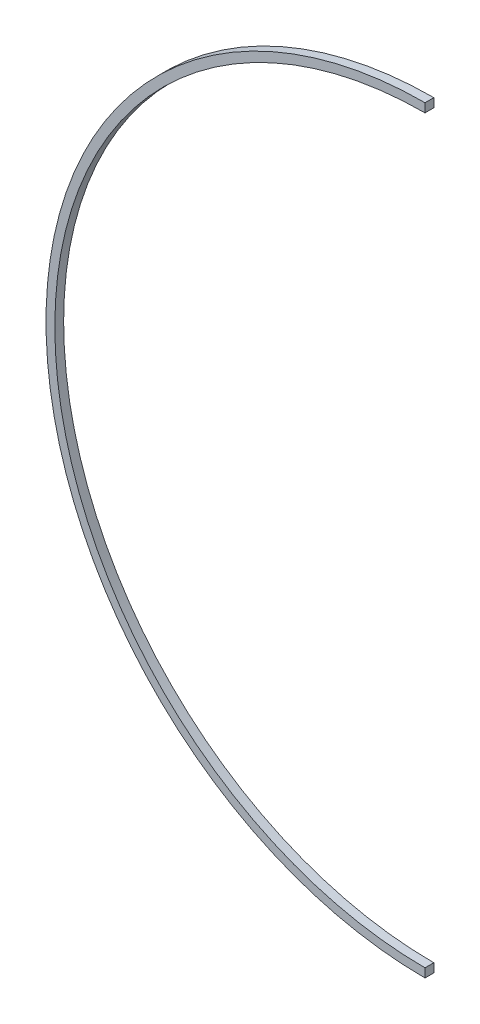
ISO-10303-21;
HEADER;
FILE_DESCRIPTION(('STEP AP214'),'2;1');
FILE_NAME('part.step','',(''),(''),'','','');
FILE_SCHEMA(('AUTOMOTIVE_DESIGN { 1 0 10303 214 1 1 1 1 }'));
ENDSEC;
DATA;
#1=APPLICATION_CONTEXT('core data for automotive mechanical design processes');
#2=APPLICATION_PROTOCOL_DEFINITION('international standard','automotive_design',2000,#1);
#3=PRODUCT_CONTEXT('',#1,'mechanical');
#4=PRODUCT('Part','Part','',(#3));
#5=PRODUCT_RELATED_PRODUCT_CATEGORY('part','',(#4));
#6=PRODUCT_DEFINITION_FORMATION('','',#4);
#7=PRODUCT_DEFINITION_CONTEXT('part definition',#1,'design');
#8=PRODUCT_DEFINITION('design','',#6,#7);
#9=PRODUCT_DEFINITION_SHAPE('','',#8);
#10=(LENGTH_UNIT() NAMED_UNIT(*) SI_UNIT(.MILLI.,.METRE.));
#11=(NAMED_UNIT(*) PLANE_ANGLE_UNIT() SI_UNIT($,.RADIAN.));
#12=(NAMED_UNIT(*) SI_UNIT($,.STERADIAN.) SOLID_ANGLE_UNIT());
#13=UNCERTAINTY_MEASURE_WITH_UNIT(LENGTH_MEASURE(1.E-05),#10,'distance_accuracy_value','');
#14=(GEOMETRIC_REPRESENTATION_CONTEXT(3) GLOBAL_UNCERTAINTY_ASSIGNED_CONTEXT((#13)) GLOBAL_UNIT_ASSIGNED_CONTEXT((#10,
#11,#12)) REPRESENTATION_CONTEXT('',''));
#15=CARTESIAN_POINT('',(0.,0.,0.));
#16=DIRECTION('',(0.,0.,1.));
#17=DIRECTION('',(1.,0.,0.));
#18=AXIS2_PLACEMENT_3D('',#15,#16,#17);
#19=CARTESIAN_POINT('',(1.50133784527703E-12,-430.,0.));
#20=DIRECTION('',(0.,0.,-1.));
#21=DIRECTION('',(-1.,0.,0.));
#22=AXIS2_PLACEMENT_3D('',#19,#20,#21);
#23=PLANE('',#22);
#24=CARTESIAN_POINT('',(0.,0.,0.));
#25=DIRECTION('',(0.,0.,-1.));
#26=DIRECTION('',(-1.,0.,0.));
#27=AXIS2_PLACEMENT_3D('',#24,#25,#26);
#28=CIRCLE('',#27,420.);
#29=CARTESIAN_POINT('',(1.46642301166594E-12,-420.,0.));
#30=VERTEX_POINT('',#29);
#31=CARTESIAN_POINT('',(1.46642301166594E-12,420.,0.));
#32=VERTEX_POINT('',#31);
#33=EDGE_CURVE('E11',#30,#32,#28,.T.);
#34=ORIENTED_EDGE('',*,*,#33,.F.);
#35=DIRECTION('',(0.,-1.,0.));
#36=VECTOR('',#35,1.);
#37=CARTESIAN_POINT('',(1.50133784527703E-12,-430.,0.));
#38=LINE('',#37,#36);
#39=CARTESIAN_POINT('',(1.50133784527703E-12,-430.,0.));
#40=VERTEX_POINT('',#39);
#41=EDGE_CURVE('E73',#30,#40,#38,.T.);
#42=ORIENTED_EDGE('',*,*,#41,.T.);
#43=CARTESIAN_POINT('',(0.,0.,0.));
#44=DIRECTION('',(0.,0.,-1.));
#45=DIRECTION('',(-1.,0.,0.));
#46=AXIS2_PLACEMENT_3D('',#43,#44,#45);
#47=CIRCLE('',#46,430.);
#48=CARTESIAN_POINT('',(1.50133784527703E-12,430.,0.));
#49=VERTEX_POINT('',#48);
#50=EDGE_CURVE('E68',#40,#49,#47,.T.);
#51=ORIENTED_EDGE('',*,*,#50,.T.);
#52=DIRECTION('',(0.,1.,0.));
#53=VECTOR('',#52,1.);
#54=CARTESIAN_POINT('',(1.50133784527703E-12,430.,0.));
#55=LINE('',#54,#53);
#56=EDGE_CURVE('E71',#32,#49,#55,.T.);
#57=ORIENTED_EDGE('',*,*,#56,.F.);
#58=EDGE_LOOP('',(#34,#42,#51,#57));
#59=FACE_BOUND('',#58,.T.);
#60=ADVANCED_FACE('F32',(#59),#23,.T.);
#61=CARTESIAN_POINT('',(0.,0.,0.));
#62=DIRECTION('',(0.,0.,-1.));
#63=DIRECTION('',(-1.,0.,0.));
#64=AXIS2_PLACEMENT_3D('',#61,#62,#63);
#65=CYLINDRICAL_SURFACE('',#64,420.);
#66=CARTESIAN_POINT('',(0.,0.,10.));
#67=DIRECTION('',(0.,0.,-1.));
#68=DIRECTION('',(-1.,0.,0.));
#69=AXIS2_PLACEMENT_3D('',#66,#67,#68);
#70=CIRCLE('',#69,420.);
#71=CARTESIAN_POINT('',(1.46642301166594E-12,-420.,10.));
#72=VERTEX_POINT('',#71);
#73=CARTESIAN_POINT('',(1.46642301166594E-12,420.,10.));
#74=VERTEX_POINT('',#73);
#75=EDGE_CURVE('E40',#72,#74,#70,.T.);
#76=ORIENTED_EDGE('',*,*,#75,.F.);
#77=DIRECTION('',(0.,0.,-1.));
#78=VECTOR('',#77,1.);
#79=CARTESIAN_POINT('',(1.46642301166594E-12,-420.,0.));
#80=LINE('',#79,#78);
#81=EDGE_CURVE('E78',#72,#30,#80,.T.);
#82=ORIENTED_EDGE('',*,*,#81,.T.);
#83=ORIENTED_EDGE('',*,*,#33,.T.);
#84=DIRECTION('',(0.,0.,-1.));
#85=VECTOR('',#84,1.);
#86=CARTESIAN_POINT('',(1.46642301166594E-12,420.,0.));
#87=LINE('',#86,#85);
#88=EDGE_CURVE('E90',#74,#32,#87,.T.);
#89=ORIENTED_EDGE('',*,*,#88,.F.);
#90=EDGE_LOOP('',(#76,#82,#83,#89));
#91=FACE_BOUND('',#90,.T.);
#92=ADVANCED_FACE('F34',(#91),#65,.F.);
#93=CARTESIAN_POINT('',(1.50133784527703E-12,-430.,10.));
#94=DIRECTION('',(0.,0.,1.));
#95=DIRECTION('',(1.,0.,0.));
#96=AXIS2_PLACEMENT_3D('',#93,#94,#95);
#97=PLANE('',#96);
#98=CARTESIAN_POINT('',(0.,0.,10.));
#99=DIRECTION('',(0.,0.,-1.));
#100=DIRECTION('',(-1.,0.,0.));
#101=AXIS2_PLACEMENT_3D('',#98,#99,#100);
#102=CIRCLE('',#101,430.);
#103=CARTESIAN_POINT('',(1.50133784527703E-12,-430.,10.));
#104=VERTEX_POINT('',#103);
#105=CARTESIAN_POINT('',(1.50133784527703E-12,430.,10.));
#106=VERTEX_POINT('',#105);
#107=EDGE_CURVE('E77',#104,#106,#102,.T.);
#108=ORIENTED_EDGE('',*,*,#107,.F.);
#109=DIRECTION('',(0.,1.,0.));
#110=VECTOR('',#109,1.);
#111=CARTESIAN_POINT('',(1.50133784527703E-12,-430.,10.));
#112=LINE('',#111,#110);
#113=EDGE_CURVE('E98',#104,#72,#112,.T.);
#114=ORIENTED_EDGE('',*,*,#113,.T.);
#115=ORIENTED_EDGE('',*,*,#75,.T.);
#116=DIRECTION('',(0.,-1.,0.));
#117=VECTOR('',#116,1.);
#118=CARTESIAN_POINT('',(1.50133784527703E-12,430.,10.));
#119=LINE('',#118,#117);
#120=EDGE_CURVE('E86',#106,#74,#119,.T.);
#121=ORIENTED_EDGE('',*,*,#120,.F.);
#122=EDGE_LOOP('',(#108,#114,#115,#121));
#123=FACE_BOUND('',#122,.T.);
#124=ADVANCED_FACE('F102',(#123),#97,.T.);
#125=CARTESIAN_POINT('',(0.,0.,0.));
#126=DIRECTION('',(0.,0.,-1.));
#127=DIRECTION('',(-1.,0.,0.));
#128=AXIS2_PLACEMENT_3D('',#125,#126,#127);
#129=CYLINDRICAL_SURFACE('',#128,430.);
#130=DIRECTION('',(0.,0.,1.));
#131=VECTOR('',#130,1.);
#132=CARTESIAN_POINT('',(1.50133784527703E-12,-430.,0.));
#133=LINE('',#132,#131);
#134=EDGE_CURVE('E96',#40,#104,#133,.T.);
#135=ORIENTED_EDGE('',*,*,#134,.T.);
#136=ORIENTED_EDGE('',*,*,#107,.T.);
#137=DIRECTION('',(0.,0.,1.));
#138=VECTOR('',#137,1.);
#139=CARTESIAN_POINT('',(1.50133784527703E-12,430.,0.));
#140=LINE('',#139,#138);
#141=EDGE_CURVE('E81',#49,#106,#140,.T.);
#142=ORIENTED_EDGE('',*,*,#141,.F.);
#143=ORIENTED_EDGE('',*,*,#50,.F.);
#144=EDGE_LOOP('',(#135,#136,#142,#143));
#145=FACE_BOUND('',#144,.T.);
#146=ADVANCED_FACE('F82',(#145),#129,.T.);
#147=CARTESIAN_POINT('',(1.46642301166594E-12,-420.,0.));
#148=DIRECTION('',(1.,0.,0.));
#149=DIRECTION('',(0.,0.,-1.));
#150=AXIS2_PLACEMENT_3D('',#147,#148,#149);
#151=PLANE('',#150);
#152=ORIENTED_EDGE('',*,*,#41,.F.);
#153=ORIENTED_EDGE('',*,*,#81,.F.);
#154=ORIENTED_EDGE('',*,*,#113,.F.);
#155=ORIENTED_EDGE('',*,*,#134,.F.);
#156=EDGE_LOOP('',(#152,#153,#154,#155));
#157=FACE_BOUND('',#156,.T.);
#158=ADVANCED_FACE('F106',(#157),#151,.T.);
#159=CARTESIAN_POINT('',(1.46642301166594E-12,420.,0.));
#160=DIRECTION('',(-1.,0.,0.));
#161=DIRECTION('',(0.,0.,-1.));
#162=AXIS2_PLACEMENT_3D('',#159,#160,#161);
#163=PLANE('',#162);
#164=ORIENTED_EDGE('',*,*,#56,.T.);
#165=ORIENTED_EDGE('',*,*,#141,.T.);
#166=ORIENTED_EDGE('',*,*,#120,.T.);
#167=ORIENTED_EDGE('',*,*,#88,.T.);
#168=EDGE_LOOP('',(#164,#165,#166,#167));
#169=FACE_BOUND('',#168,.T.);
#170=ADVANCED_FACE('F89',(#169),#163,.F.);
#171=CLOSED_SHELL('',(#60,#92,#124,#146,#158,#170));
#172=MANIFOLD_SOLID_BREP('B2',#171);
#173=ADVANCED_BREP_SHAPE_REPRESENTATION('',(#18,#172),#14);
#174=SHAPE_DEFINITION_REPRESENTATION(#9,#173);
ENDSEC;
END-ISO-10303-21;
